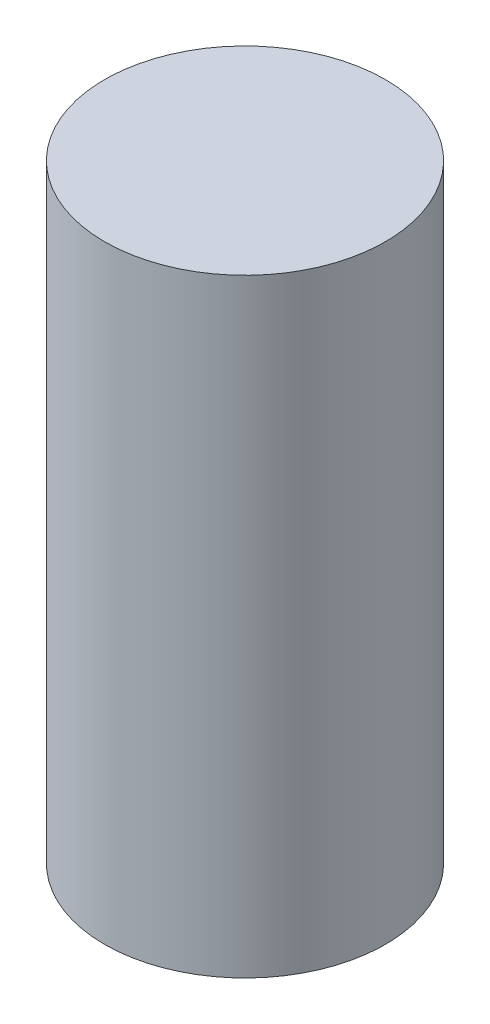
ISO-10303-21;
HEADER;
FILE_DESCRIPTION(('STEP AP214'),'2;1');
FILE_NAME('part.step','',(''),(''),'','','');
FILE_SCHEMA(('AUTOMOTIVE_DESIGN { 1 0 10303 214 1 1 1 1 }'));
ENDSEC;
DATA;
#1=APPLICATION_CONTEXT('core data for automotive mechanical design processes');
#2=APPLICATION_PROTOCOL_DEFINITION('international standard','automotive_design',2000,#1);
#3=PRODUCT_CONTEXT('',#1,'mechanical');
#4=PRODUCT('Part','Part','',(#3));
#5=PRODUCT_RELATED_PRODUCT_CATEGORY('part','',(#4));
#6=PRODUCT_DEFINITION_FORMATION('','',#4);
#7=PRODUCT_DEFINITION_CONTEXT('part definition',#1,'design');
#8=PRODUCT_DEFINITION('design','',#6,#7);
#9=PRODUCT_DEFINITION_SHAPE('','',#8);
#10=(LENGTH_UNIT() NAMED_UNIT(*) SI_UNIT(.MILLI.,.METRE.));
#11=(NAMED_UNIT(*) PLANE_ANGLE_UNIT() SI_UNIT($,.RADIAN.));
#12=(NAMED_UNIT(*) SI_UNIT($,.STERADIAN.) SOLID_ANGLE_UNIT());
#13=UNCERTAINTY_MEASURE_WITH_UNIT(LENGTH_MEASURE(1.E-05),#10,'distance_accuracy_value','');
#14=(GEOMETRIC_REPRESENTATION_CONTEXT(3) GLOBAL_UNCERTAINTY_ASSIGNED_CONTEXT((#13)) GLOBAL_UNIT_ASSIGNED_CONTEXT((#10,
#11,#12)) REPRESENTATION_CONTEXT('',''));
#15=CARTESIAN_POINT('',(0.,0.,0.));
#16=DIRECTION('',(0.,0.,1.));
#17=DIRECTION('',(1.,0.,0.));
#18=AXIS2_PLACEMENT_3D('',#15,#16,#17);
#19=CARTESIAN_POINT('',(-12.5991751027072,13.,-5.12249579293211));
#20=DIRECTION('',(0.,-1.,0.));
#21=DIRECTION('',(0.,0.,-1.));
#22=AXIS2_PLACEMENT_3D('',#19,#20,#21);
#23=CYLINDRICAL_SURFACE('',#22,3.);
#24=CARTESIAN_POINT('',(-12.5991751027072,13.,-5.12249579293211));
#25=DIRECTION('',(0.,1.,0.));
#26=DIRECTION('',(0.,0.,1.));
#27=AXIS2_PLACEMENT_3D('',#24,#25,#26);
#28=CIRCLE('',#27,3.);
#29=CARTESIAN_POINT('',(-12.5991751027072,13.,-2.12249579293211));
#30=VERTEX_POINT('',#29);
#31=EDGE_CURVE('E10',#30,#30,#28,.T.);
#32=ORIENTED_EDGE('',*,*,#31,.F.);
#33=EDGE_LOOP('',(#32));
#34=FACE_BOUND('',#33,.T.);
#35=CARTESIAN_POINT('',(-12.5991751027072,0.,-5.12249579293211));
#36=DIRECTION('',(0.,1.,0.));
#37=DIRECTION('',(0.,0.,1.));
#38=AXIS2_PLACEMENT_3D('',#35,#36,#37);
#39=CIRCLE('',#38,3.);
#40=CARTESIAN_POINT('',(-12.5991751027072,0.,-2.12249579293211));
#41=VERTEX_POINT('',#40);
#42=EDGE_CURVE('E38',#41,#41,#39,.T.);
#43=ORIENTED_EDGE('',*,*,#42,.T.);
#44=EDGE_LOOP('',(#43));
#45=FACE_BOUND('',#44,.T.);
#46=ADVANCED_FACE('F35',(#34,#45),#23,.T.);
#47=CARTESIAN_POINT('',(-12.5991751027072,13.,-5.12249579293211));
#48=DIRECTION('',(0.,1.,0.));
#49=DIRECTION('',(0.,0.,1.));
#50=AXIS2_PLACEMENT_3D('',#47,#48,#49);
#51=PLANE('',#50);
#52=ORIENTED_EDGE('',*,*,#31,.T.);
#53=EDGE_LOOP('',(#52));
#54=FACE_BOUND('',#53,.T.);
#55=ADVANCED_FACE('F50',(#54),#51,.T.);
#56=CARTESIAN_POINT('',(-12.5991751027072,0.,-5.12249579293211));
#57=DIRECTION('',(0.,1.,0.));
#58=DIRECTION('',(0.,0.,1.));
#59=AXIS2_PLACEMENT_3D('',#56,#57,#58);
#60=PLANE('',#59);
#61=ORIENTED_EDGE('',*,*,#42,.F.);
#62=EDGE_LOOP('',(#61));
#63=FACE_BOUND('',#62,.T.);
#64=ADVANCED_FACE('F48',(#63),#60,.F.);
#65=CLOSED_SHELL('',(#46,#55,#64));
#66=MANIFOLD_SOLID_BREP('B2',#65);
#67=ADVANCED_BREP_SHAPE_REPRESENTATION('',(#18,#66),#14);
#68=SHAPE_DEFINITION_REPRESENTATION(#9,#67);
ENDSEC;
END-ISO-10303-21;
